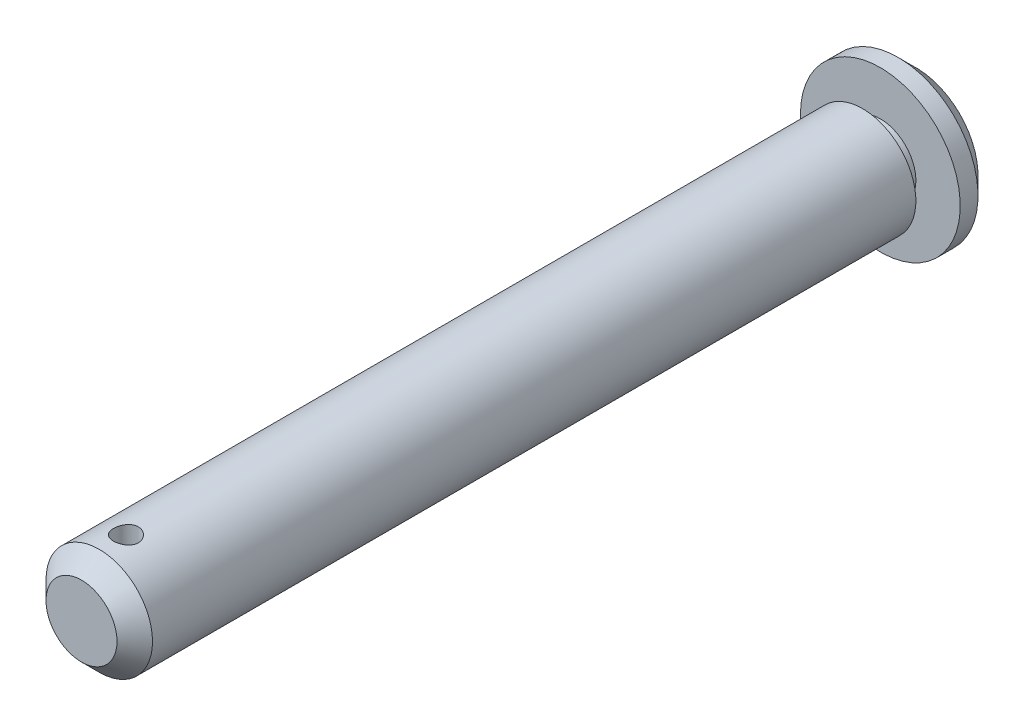
ISO-10303-21;
HEADER;
FILE_DESCRIPTION(('STEP AP214'),'2;1');
FILE_NAME('part.step','',(''),(''),'','','');
FILE_SCHEMA(('AUTOMOTIVE_DESIGN { 1 0 10303 214 1 1 1 1 }'));
ENDSEC;
DATA;
#1=APPLICATION_CONTEXT('core data for automotive mechanical design processes');
#2=APPLICATION_PROTOCOL_DEFINITION('international standard','automotive_design',2000,#1);
#3=PRODUCT_CONTEXT('',#1,'mechanical');
#4=PRODUCT('Part','Part','',(#3));
#5=PRODUCT_RELATED_PRODUCT_CATEGORY('part','',(#4));
#6=PRODUCT_DEFINITION_FORMATION('','',#4);
#7=PRODUCT_DEFINITION_CONTEXT('part definition',#1,'design');
#8=PRODUCT_DEFINITION('design','',#6,#7);
#9=PRODUCT_DEFINITION_SHAPE('','',#8);
#10=(LENGTH_UNIT() NAMED_UNIT(*) SI_UNIT(.MILLI.,.METRE.));
#11=(NAMED_UNIT(*) PLANE_ANGLE_UNIT() SI_UNIT($,.RADIAN.));
#12=(NAMED_UNIT(*) SI_UNIT($,.STERADIAN.) SOLID_ANGLE_UNIT());
#13=UNCERTAINTY_MEASURE_WITH_UNIT(LENGTH_MEASURE(1.E-05),#10,'distance_accuracy_value','');
#14=(GEOMETRIC_REPRESENTATION_CONTEXT(3) GLOBAL_UNCERTAINTY_ASSIGNED_CONTEXT((#13)) GLOBAL_UNIT_ASSIGNED_CONTEXT((#10,
#11,#12)) REPRESENTATION_CONTEXT('',''));
#15=CARTESIAN_POINT('',(0.,0.,0.));
#16=DIRECTION('',(0.,0.,1.));
#17=DIRECTION('',(1.,0.,0.));
#18=AXIS2_PLACEMENT_3D('',#15,#16,#17);
#19=CARTESIAN_POINT('',(0.,0.,0.));
#20=DIRECTION('',(0.,0.,1.));
#21=DIRECTION('',(1.,0.,0.));
#22=AXIS2_PLACEMENT_3D('',#19,#20,#21);
#23=PLANE('',#22);
#24=CARTESIAN_POINT('',(0.,0.,0.));
#25=DIRECTION('',(0.,0.,1.));
#26=DIRECTION('',(1.,0.,0.));
#27=AXIS2_PLACEMENT_3D('',#24,#25,#26);
#28=CIRCLE('',#27,2.00000000000001);
#29=CARTESIAN_POINT('',(2.00000000000001,0.,0.));
#30=VERTEX_POINT('',#29);
#31=EDGE_CURVE('E43',#30,#30,#28,.T.);
#32=ORIENTED_EDGE('',*,*,#31,.T.);
#33=EDGE_LOOP('',(#32));
#34=FACE_BOUND('',#33,.T.);
#35=ADVANCED_FACE('F32',(#34),#23,.T.);
#36=CARTESIAN_POINT('',(0.,0.,-47.));
#37=DIRECTION('',(0.,0.,-1.));
#38=DIRECTION('',(-1.,0.,0.));
#39=AXIS2_PLACEMENT_3D('',#36,#37,#38);
#40=CYLINDRICAL_SURFACE('',#39,3.);
#41=CARTESIAN_POINT('',(0.,0.,-0.999999999999987));
#42=DIRECTION('',(0.,0.,1.));
#43=DIRECTION('',(1.,0.,0.));
#44=AXIS2_PLACEMENT_3D('',#41,#42,#43);
#45=CIRCLE('',#44,3.);
#46=CARTESIAN_POINT('',(3.,0.,-0.999999999999987));
#47=VERTEX_POINT('',#46);
#48=EDGE_CURVE('E47',#47,#47,#45,.F.);
#49=ORIENTED_EDGE('',*,*,#48,.T.);
#50=EDGE_LOOP('',(#49));
#51=FACE_BOUND('',#50,.T.);
#52=CARTESIAN_POINT('',(0.,-3.,-1.8));
#53=CARTESIAN_POINT('',(-0.0387568275904303,-2.99999930231038,-1.80000122475109));
#54=CARTESIAN_POINT('',(-0.077527926090209,-2.99924138860332,-1.80322962052179));
#55=CARTESIAN_POINT('',(-0.153964355844702,-2.99629122555336,-1.81604183065357));
#56=CARTESIAN_POINT('',(-0.191628954369387,-2.99409804718746,-1.82562976149074));
#57=CARTESIAN_POINT('',(-0.264737067909907,-2.98852094902286,-1.85084084487668));
#58=CARTESIAN_POINT('',(-0.300183010279934,-2.98513835832486,-1.8664572628318));
#59=CARTESIAN_POINT('',(-0.367951228110604,-2.9775453193121,-1.90325958297396));
#60=CARTESIAN_POINT('',(-0.400273498836706,-2.97333486974259,-1.92444549360248));
#61=CARTESIAN_POINT('',(-0.461462979624396,-2.96446022027653,-1.97219117999056));
#62=CARTESIAN_POINT('',(-0.490265522898178,-2.95978975967682,-1.99883267308526));
#63=CARTESIAN_POINT('',(-0.543036619235344,-2.95056443308662,-2.05655805155119));
#64=CARTESIAN_POINT('',(-0.567004691963645,-2.94600957862161,-2.08764237782215));
#65=CARTESIAN_POINT('',(-0.609720258661536,-2.93746885752158,-2.15386000852436));
#66=CARTESIAN_POINT('',(-0.628397333551587,-2.93349098127653,-2.18903986216225));
#67=CARTESIAN_POINT('',(-0.65954851852384,-2.92664515060188,-2.26214734436777));
#68=CARTESIAN_POINT('',(-0.672023481476812,-2.92377704357666,-2.30007459431052));
#69=CARTESIAN_POINT('',(-0.690199482217611,-2.91953953127137,-2.37689430883357));
#70=CARTESIAN_POINT('',(-0.696015835093373,-2.91814464647746,-2.41575805244962));
#71=CARTESIAN_POINT('',(-0.701068363799087,-2.91693510858913,-2.49393280444522));
#72=CARTESIAN_POINT('',(-0.700305465035226,-2.91712023325807,-2.53324374914683));
#73=CARTESIAN_POINT('',(-0.692313585034032,-2.91902680303702,-2.61032794857285));
#74=CARTESIAN_POINT('',(-0.685220095657972,-2.92071605402813,-2.64811616931967));
#75=CARTESIAN_POINT('',(-0.664983719394817,-2.9253894582439,-2.72195092980324));
#76=CARTESIAN_POINT('',(-0.651840451464232,-2.92837369303204,-2.75799735967576));
#77=CARTESIAN_POINT('',(-0.619757276544303,-2.93533155315182,-2.82769824244883));
#78=CARTESIAN_POINT('',(-0.600766600275995,-2.93931378475101,-2.86132843132516));
#79=CARTESIAN_POINT('',(-0.557563290499968,-2.94781385649384,-2.92497422305259));
#80=CARTESIAN_POINT('',(-0.533349853055532,-2.95233177904783,-2.95498926831693));
#81=CARTESIAN_POINT('',(-0.479678060510791,-2.96153115527003,-3.01133124562877));
#82=CARTESIAN_POINT('',(-0.450104875328551,-2.96621389103577,-3.0375487017123));
#83=CARTESIAN_POINT('',(-0.38692699527782,-2.97511404536421,-3.08467126228309));
#84=CARTESIAN_POINT('',(-0.353322206496245,-2.97933145308307,-3.10557624298498));
#85=CARTESIAN_POINT('',(-0.282891253492208,-2.98684256664561,-3.14151334587868));
#86=CARTESIAN_POINT('',(-0.246056696201606,-2.99013376632089,-3.1565295764085));
#87=CARTESIAN_POINT('',(-0.170292807588434,-2.99540322643007,-3.18012785573254));
#88=CARTESIAN_POINT('',(-0.131363825153092,-2.99738170480818,-3.18871097261349));
#89=CARTESIAN_POINT('',(-0.0534537942300148,-2.99977122201387,-3.1990365681662));
#90=CARTESIAN_POINT('',(-0.0144935583276208,-3.00021647191604,-3.20092837714057));
#91=CARTESIAN_POINT('',(0.0631864227643716,-2.99958594191354,-3.19822458268463));
#92=CARTESIAN_POINT('',(0.101906186415341,-2.99851028025804,-3.1936294836042));
#93=CARTESIAN_POINT('',(0.177500428076711,-2.99498053429404,-3.17820584748606));
#94=CARTESIAN_POINT('',(0.214392074332031,-2.9925440939738,-3.16745705601246));
#95=CARTESIAN_POINT('',(0.285847949772057,-2.98656620093982,-3.14012082631615));
#96=CARTESIAN_POINT('',(0.320411962525002,-2.98302464564052,-3.12353284603515));
#97=CARTESIAN_POINT('',(0.386838432816381,-2.97514597920219,-3.08468784922727));
#98=CARTESIAN_POINT('',(0.418649240446618,-2.9707971217843,-3.06234494673881));
#99=CARTESIAN_POINT('',(0.478123395146006,-2.96180760471102,-3.01273590611791));
#100=CARTESIAN_POINT('',(0.505786122698787,-2.95716690161504,-2.98546903392765));
#101=CARTESIAN_POINT('',(0.556780719269184,-2.94799626826594,-2.92609685222967));
#102=CARTESIAN_POINT('',(0.58000852948651,-2.9434707616056,-2.89390134860149));
#103=CARTESIAN_POINT('',(0.620729338762077,-2.93515395619035,-2.82597959417895));
#104=CARTESIAN_POINT('',(0.638222593658529,-2.93136262468445,-2.7902535009889));
#105=CARTESIAN_POINT('',(0.666852672701944,-2.92498252731811,-2.71647977000186));
#106=CARTESIAN_POINT('',(0.678026628701683,-2.92238675351838,-2.67844717909831));
#107=CARTESIAN_POINT('',(0.693805497047128,-2.91868135294602,-2.60097475812476));
#108=CARTESIAN_POINT('',(0.698411629847287,-2.91757145006633,-2.56153519090027));
#109=CARTESIAN_POINT('',(0.700866695503486,-2.9169825334026,-2.48342172525));
#110=CARTESIAN_POINT('',(0.698881174718093,-2.91746356292556,-2.44475324177562));
#111=CARTESIAN_POINT('',(0.68858335414095,-2.91991103408463,-2.36831848010456));
#112=CARTESIAN_POINT('',(0.68027115130334,-2.92187745295769,-2.33055218809128));
#113=CARTESIAN_POINT('',(0.657640758090693,-2.92705336708224,-2.25714725476981));
#114=CARTESIAN_POINT('',(0.643349812401463,-2.93025721842348,-2.22149978927411));
#115=CARTESIAN_POINT('',(0.609189934206348,-2.93754852004272,-2.15308500202411));
#116=CARTESIAN_POINT('',(0.589320330706113,-2.94163607659811,-2.12031802735475));
#117=CARTESIAN_POINT('',(0.544031717337374,-2.95035113826687,-2.05778544845911));
#118=CARTESIAN_POINT('',(0.518496108741533,-2.9549888598669,-2.02810569795504));
#119=CARTESIAN_POINT('',(0.462832618993101,-2.96421665501473,-1.97339846919591));
#120=CARTESIAN_POINT('',(0.432703667310726,-2.96880671718791,-1.94837207848405));
#121=CARTESIAN_POINT('',(0.368155688067127,-2.97750512274554,-1.90331409369141));
#122=CARTESIAN_POINT('',(0.333678359340243,-2.98160507375448,-1.88336429305148));
#123=CARTESIAN_POINT('',(0.261769131843766,-2.98877534070089,-1.84957521569021));
#124=CARTESIAN_POINT('',(0.224339578019469,-2.99184646385879,-1.83573114568771));
#125=CARTESIAN_POINT('',(0.155764092090431,-2.99610696244778,-1.81682989219721));
#126=CARTESIAN_POINT('',(0.124970474288143,-2.99755737306338,-1.81053142605946));
#127=CARTESIAN_POINT('',(0.0627876704666706,-2.99950414730721,-1.80211610283141));
#128=CARTESIAN_POINT('',(0.0313985184421443,-3.00000056522738,-1.79999900777819));
#129=CARTESIAN_POINT('',(0.,-3.,-1.8));
#130=B_SPLINE_CURVE_WITH_KNOTS('',3,(#52,#53,#54,#55,#56,#57,#58,#59,#60,#61,#62,#63,#64,#65,
#66,#67,#68,#69,#70,#71,#72,#73,#74,#75,#76,#77,#78,#79,#80,#81,#82,#83,#84,#85,#86,#87,#88,#89,
#90,#91,#92,#93,#94,#95,#96,#97,#98,#99,#100,#101,#102,#103,#104,#105,#106,#107,#108,#109,#110,
#111,#112,#113,#114,#115,#116,#117,#118,#119,#120,#121,#122,#123,#124,#125,#126,#127,#128,#129),
.UNSPECIFIED.,.T.,.F.,(4,2,2,2,2,2,2,2,2,2,2,2,2,2,2,2,2,2,2,2,2,2,2,2,2,2,2,2,2,2,2,2,2,2,2,2,
2,2,4),(0.,0.116155492959679,0.232386245908476,0.348487528198088,0.464588986459406,
0.582576757191584,0.70057624498335,0.82007942476726,0.939566166766685,1.05695072959114,
1.17431878193162,1.28923352596519,1.4041555088601,1.52010484847293,1.63607204885624,
1.75490515703043,1.87374103386748,1.99289543559479,2.11203004978968,2.22848854369423,
2.34493798357922,2.45991145414755,2.57489560064481,2.69170669561784,2.80853521900645,
2.92783651281347,3.04713248345538,3.16571999359298,3.2842854645373,3.39989596837181,
3.51550470055238,3.6305922538747,3.74569365572602,3.86342932024183,3.9811924664321,
4.10074746266924,4.22020843490608,4.31431618805317,4.40841858534926),.UNSPECIFIED.);
#131=CARTESIAN_POINT('',(0.,-3.,-1.8));
#132=VERTEX_POINT('',#131);
#133=EDGE_CURVE('E53',#132,#132,#130,.T.);
#134=ORIENTED_EDGE('',*,*,#133,.F.);
#135=EDGE_LOOP('',(#134));
#136=FACE_BOUND('',#135,.T.);
#137=CARTESIAN_POINT('',(0.,3.,-1.8));
#138=CARTESIAN_POINT('',(0.0387568275904303,2.99999930231038,-1.80000122475109));
#139=CARTESIAN_POINT('',(0.077527926090209,2.99924138860332,-1.80322962052179));
#140=CARTESIAN_POINT('',(0.153964355844702,2.99629122555336,-1.81604183065357));
#141=CARTESIAN_POINT('',(0.191628954369387,2.99409804718746,-1.82562976149074));
#142=CARTESIAN_POINT('',(0.264737067909907,2.98852094902286,-1.85084084487668));
#143=CARTESIAN_POINT('',(0.300183010279934,2.98513835832486,-1.8664572628318));
#144=CARTESIAN_POINT('',(0.367951228110604,2.9775453193121,-1.90325958297396));
#145=CARTESIAN_POINT('',(0.400273498836706,2.97333486974259,-1.92444549360248));
#146=CARTESIAN_POINT('',(0.461462979624396,2.96446022027653,-1.97219117999056));
#147=CARTESIAN_POINT('',(0.490265522898178,2.95978975967682,-1.99883267308526));
#148=CARTESIAN_POINT('',(0.543036619235344,2.95056443308662,-2.05655805155119));
#149=CARTESIAN_POINT('',(0.567004691963645,2.94600957862161,-2.08764237782215));
#150=CARTESIAN_POINT('',(0.609720258661535,2.93746885752158,-2.15386000852436));
#151=CARTESIAN_POINT('',(0.628397333551587,2.93349098127653,-2.18903986216225));
#152=CARTESIAN_POINT('',(0.65954851852384,2.92664515060188,-2.26214734436777));
#153=CARTESIAN_POINT('',(0.672023481476812,2.92377704357666,-2.30007459431052));
#154=CARTESIAN_POINT('',(0.690199482217611,2.91953953127137,-2.37689430883357));
#155=CARTESIAN_POINT('',(0.696015835093373,2.91814464647746,-2.41575805244962));
#156=CARTESIAN_POINT('',(0.701068363799087,2.91693510858913,-2.49393280444522));
#157=CARTESIAN_POINT('',(0.700305465035226,2.91712023325807,-2.53324374914683));
#158=CARTESIAN_POINT('',(0.692313585034032,2.91902680303702,-2.61032794857285));
#159=CARTESIAN_POINT('',(0.685220095657972,2.92071605402813,-2.64811616931967));
#160=CARTESIAN_POINT('',(0.664983719394817,2.9253894582439,-2.72195092980324));
#161=CARTESIAN_POINT('',(0.651840451464232,2.92837369303204,-2.75799735967576));
#162=CARTESIAN_POINT('',(0.619757276544303,2.93533155315182,-2.82769824244883));
#163=CARTESIAN_POINT('',(0.600766600275995,2.93931378475101,-2.86132843132516));
#164=CARTESIAN_POINT('',(0.557563290499968,2.94781385649384,-2.92497422305259));
#165=CARTESIAN_POINT('',(0.533349853055532,2.95233177904783,-2.95498926831693));
#166=CARTESIAN_POINT('',(0.479678060510791,2.96153115527003,-3.01133124562877));
#167=CARTESIAN_POINT('',(0.450104875328551,2.96621389103577,-3.0375487017123));
#168=CARTESIAN_POINT('',(0.38692699527782,2.97511404536421,-3.08467126228309));
#169=CARTESIAN_POINT('',(0.353322206496245,2.97933145308307,-3.10557624298498));
#170=CARTESIAN_POINT('',(0.282891253492208,2.98684256664561,-3.14151334587868));
#171=CARTESIAN_POINT('',(0.246056696201606,2.99013376632089,-3.1565295764085));
#172=CARTESIAN_POINT('',(0.170292807588434,2.99540322643007,-3.18012785573254));
#173=CARTESIAN_POINT('',(0.131363825153092,2.99738170480818,-3.18871097261349));
#174=CARTESIAN_POINT('',(0.0534537942300148,2.99977122201387,-3.1990365681662));
#175=CARTESIAN_POINT('',(0.0144935583276209,3.00021647191604,-3.20092837714057));
#176=CARTESIAN_POINT('',(-0.0631864227643716,2.99958594191354,-3.19822458268463));
#177=CARTESIAN_POINT('',(-0.101906186415341,2.99851028025804,-3.1936294836042));
#178=CARTESIAN_POINT('',(-0.177500428076711,2.99498053429404,-3.17820584748606));
#179=CARTESIAN_POINT('',(-0.214392074332031,2.9925440939738,-3.16745705601246));
#180=CARTESIAN_POINT('',(-0.285847949772057,2.98656620093982,-3.14012082631615));
#181=CARTESIAN_POINT('',(-0.320411962525002,2.98302464564052,-3.12353284603515));
#182=CARTESIAN_POINT('',(-0.386838432816381,2.97514597920219,-3.08468784922727));
#183=CARTESIAN_POINT('',(-0.418649240446618,2.9707971217843,-3.06234494673881));
#184=CARTESIAN_POINT('',(-0.478123395146006,2.96180760471102,-3.01273590611791));
#185=CARTESIAN_POINT('',(-0.505786122698787,2.95716690161504,-2.98546903392765));
#186=CARTESIAN_POINT('',(-0.556780719269184,2.94799626826594,-2.92609685222967));
#187=CARTESIAN_POINT('',(-0.580008529486511,2.9434707616056,-2.89390134860149));
#188=CARTESIAN_POINT('',(-0.620729338762077,2.93515395619035,-2.82597959417895));
#189=CARTESIAN_POINT('',(-0.638222593658528,2.93136262468445,-2.7902535009889));
#190=CARTESIAN_POINT('',(-0.666852672701943,2.92498252731811,-2.71647977000186));
#191=CARTESIAN_POINT('',(-0.678026628701683,2.92238675351838,-2.67844717909831));
#192=CARTESIAN_POINT('',(-0.693805497047128,2.91868135294602,-2.60097475812476));
#193=CARTESIAN_POINT('',(-0.698411629847287,2.91757145006633,-2.56153519090027));
#194=CARTESIAN_POINT('',(-0.700866695503486,2.9169825334026,-2.48342172525));
#195=CARTESIAN_POINT('',(-0.698881174718093,2.91746356292556,-2.44475324177562));
#196=CARTESIAN_POINT('',(-0.68858335414095,2.91991103408463,-2.36831848010456));
#197=CARTESIAN_POINT('',(-0.68027115130334,2.92187745295769,-2.33055218809128));
#198=CARTESIAN_POINT('',(-0.657640758090693,2.92705336708224,-2.25714725476981));
#199=CARTESIAN_POINT('',(-0.643349812401463,2.93025721842348,-2.22149978927411));
#200=CARTESIAN_POINT('',(-0.609189934206348,2.93754852004272,-2.15308500202411));
#201=CARTESIAN_POINT('',(-0.589320330706113,2.94163607659811,-2.12031802735475));
#202=CARTESIAN_POINT('',(-0.544031717337374,2.95035113826687,-2.05778544845911));
#203=CARTESIAN_POINT('',(-0.518496108741533,2.9549888598669,-2.02810569795504));
#204=CARTESIAN_POINT('',(-0.462832618993101,2.96421665501473,-1.97339846919592));
#205=CARTESIAN_POINT('',(-0.432703667310726,2.96880671718791,-1.94837207848405));
#206=CARTESIAN_POINT('',(-0.368155688067128,2.97750512274554,-1.90331409369141));
#207=CARTESIAN_POINT('',(-0.333678359340243,2.98160507375449,-1.88336429305148));
#208=CARTESIAN_POINT('',(-0.261769131843766,2.98877534070089,-1.84957521569021));
#209=CARTESIAN_POINT('',(-0.224339578019469,2.99184646385879,-1.83573114568771));
#210=CARTESIAN_POINT('',(-0.155764092090431,2.99610696244778,-1.81682989219721));
#211=CARTESIAN_POINT('',(-0.124970474288143,2.99755737306338,-1.81053142605946));
#212=CARTESIAN_POINT('',(-0.0627876704666709,2.99950414730721,-1.80211610283141));
#213=CARTESIAN_POINT('',(-0.0313985184421444,3.00000056522738,-1.79999900777819));
#214=CARTESIAN_POINT('',(0.,3.,-1.8));
#215=B_SPLINE_CURVE_WITH_KNOTS('',3,(#137,#138,#139,#140,#141,#142,#143,#144,#145,#146,#147,
#148,#149,#150,#151,#152,#153,#154,#155,#156,#157,#158,#159,#160,#161,#162,#163,#164,#165,#166,
#167,#168,#169,#170,#171,#172,#173,#174,#175,#176,#177,#178,#179,#180,#181,#182,#183,#184,#185,
#186,#187,#188,#189,#190,#191,#192,#193,#194,#195,#196,#197,#198,#199,#200,#201,#202,#203,#204,
#205,#206,#207,#208,#209,#210,#211,#212,#213,#214),.UNSPECIFIED.,.T.,.F.,(4,2,2,2,2,2,2,2,2,2,2,
2,2,2,2,2,2,2,2,2,2,2,2,2,2,2,2,2,2,2,2,2,2,2,2,2,2,2,4),(0.,0.116155492959679,
0.232386245908476,0.348487528198088,0.464588986459406,0.582576757191584,0.70057624498335,
0.820079424767259,0.939566166766685,1.05695072959114,1.17431878193162,1.28923352596519,
1.4041555088601,1.52010484847293,1.63607204885624,1.75490515703043,1.87374103386748,
1.99289543559479,2.11203004978968,2.22848854369423,2.34493798357922,2.45991145414755,
2.57489560064481,2.69170669561784,2.80853521900645,2.92783651281347,3.04713248345538,
3.16571999359298,3.2842854645373,3.39989596837181,3.51550470055238,3.6305922538747,
3.74569365572602,3.86342932024183,3.9811924664321,4.10074746266924,4.22020843490608,
4.31431618805317,4.40841858534926),.UNSPECIFIED.);
#216=CARTESIAN_POINT('',(0.,3.,-1.8));
#217=VERTEX_POINT('',#216);
#218=EDGE_CURVE('E62',#217,#217,#215,.T.);
#219=ORIENTED_EDGE('',*,*,#218,.F.);
#220=EDGE_LOOP('',(#219));
#221=FACE_BOUND('',#220,.T.);
#222=CARTESIAN_POINT('',(0.,0.,-44.));
#223=DIRECTION('',(0.,0.,-1.));
#224=DIRECTION('',(-1.,0.,0.));
#225=AXIS2_PLACEMENT_3D('',#222,#223,#224);
#226=CIRCLE('',#225,3.);
#227=CARTESIAN_POINT('',(-3.,0.,-44.));
#228=VERTEX_POINT('',#227);
#229=EDGE_CURVE('E52',#228,#228,#226,.T.);
#230=ORIENTED_EDGE('',*,*,#229,.F.);
#231=EDGE_LOOP('',(#230));
#232=FACE_BOUND('',#231,.T.);
#233=ADVANCED_FACE('F67',(#51,#136,#221,#232),#40,.T.);
#234=CARTESIAN_POINT('',(-3.,0.,-44.));
#235=DIRECTION('',(0.,0.,-1.));
#236=DIRECTION('',(-1.,0.,0.));
#237=AXIS2_PLACEMENT_3D('',#234,#235,#236);
#238=PLANE('',#237);
#239=ORIENTED_EDGE('',*,*,#229,.T.);
#240=EDGE_LOOP('',(#239));
#241=FACE_BOUND('',#240,.T.);
#242=CARTESIAN_POINT('',(0.,0.,-44.));
#243=DIRECTION('',(0.,0.,-1.));
#244=DIRECTION('',(-1.,0.,0.));
#245=AXIS2_PLACEMENT_3D('',#242,#243,#244);
#246=CIRCLE('',#245,2.);
#247=CARTESIAN_POINT('',(-2.,0.,-44.));
#248=VERTEX_POINT('',#247);
#249=EDGE_CURVE('E120',#248,#248,#246,.T.);
#250=ORIENTED_EDGE('',*,*,#249,.F.);
#251=EDGE_LOOP('',(#250));
#252=FACE_BOUND('',#251,.T.);
#253=ADVANCED_FACE('F90',(#241,#252),#238,.T.);
#254=CARTESIAN_POINT('',(0.,0.,-47.));
#255=DIRECTION('',(0.,0.,-1.));
#256=DIRECTION('',(-1.,0.,0.));
#257=AXIS2_PLACEMENT_3D('',#254,#255,#256);
#258=CYLINDRICAL_SURFACE('',#257,2.);
#259=ORIENTED_EDGE('',*,*,#249,.T.);
#260=EDGE_LOOP('',(#259));
#261=FACE_BOUND('',#260,.T.);
#262=CARTESIAN_POINT('',(0.,0.,-45.));
#263=DIRECTION('',(0.,0.,-1.));
#264=DIRECTION('',(-1.,0.,0.));
#265=AXIS2_PLACEMENT_3D('',#262,#263,#264);
#266=CIRCLE('',#265,2.);
#267=CARTESIAN_POINT('',(-2.,0.,-45.));
#268=VERTEX_POINT('',#267);
#269=EDGE_CURVE('E122',#268,#268,#266,.T.);
#270=ORIENTED_EDGE('',*,*,#269,.F.);
#271=EDGE_LOOP('',(#270));
#272=FACE_BOUND('',#271,.T.);
#273=ADVANCED_FACE('F87',(#261,#272),#258,.T.);
#274=CARTESIAN_POINT('',(-2.,0.,-45.));
#275=DIRECTION('',(0.,0.,1.));
#276=DIRECTION('',(1.,0.,0.));
#277=AXIS2_PLACEMENT_3D('',#274,#275,#276);
#278=PLANE('',#277);
#279=ORIENTED_EDGE('',*,*,#269,.T.);
#280=EDGE_LOOP('',(#279));
#281=FACE_BOUND('',#280,.T.);
#282=CARTESIAN_POINT('',(0.,0.,-45.));
#283=DIRECTION('',(0.,0.,-1.));
#284=DIRECTION('',(-1.,0.,0.));
#285=AXIS2_PLACEMENT_3D('',#282,#283,#284);
#286=CIRCLE('',#285,4.5);
#287=CARTESIAN_POINT('',(-4.5,0.,-45.));
#288=VERTEX_POINT('',#287);
#289=EDGE_CURVE('E61',#288,#288,#286,.T.);
#290=ORIENTED_EDGE('',*,*,#289,.F.);
#291=EDGE_LOOP('',(#290));
#292=FACE_BOUND('',#291,.T.);
#293=ADVANCED_FACE('F84',(#281,#292),#278,.T.);
#294=CARTESIAN_POINT('',(0.,0.,-47.));
#295=DIRECTION('',(0.,0.,-1.));
#296=DIRECTION('',(-1.,0.,0.));
#297=AXIS2_PLACEMENT_3D('',#294,#295,#296);
#298=CYLINDRICAL_SURFACE('',#297,4.5);
#299=CARTESIAN_POINT('',(0.,0.,-46.));
#300=DIRECTION('',(0.,0.,-1.));
#301=DIRECTION('',(-1.,0.,0.));
#302=AXIS2_PLACEMENT_3D('',#299,#300,#301);
#303=CIRCLE('',#302,4.5);
#304=CARTESIAN_POINT('',(-4.5,0.,-46.));
#305=VERTEX_POINT('',#304);
#306=EDGE_CURVE('E10',#305,#305,#303,.F.);
#307=ORIENTED_EDGE('',*,*,#306,.T.);
#308=EDGE_LOOP('',(#307));
#309=FACE_BOUND('',#308,.T.);
#310=ORIENTED_EDGE('',*,*,#289,.T.);
#311=EDGE_LOOP('',(#310));
#312=FACE_BOUND('',#311,.T.);
#313=ADVANCED_FACE('F81',(#309,#312),#298,.T.);
#314=CARTESIAN_POINT('',(-4.5,0.,-47.));
#315=DIRECTION('',(0.,0.,-1.));
#316=DIRECTION('',(-1.,0.,0.));
#317=AXIS2_PLACEMENT_3D('',#314,#315,#316);
#318=PLANE('',#317);
#319=CARTESIAN_POINT('',(0.,0.,-47.));
#320=DIRECTION('',(0.,0.,-1.));
#321=DIRECTION('',(-1.,0.,0.));
#322=AXIS2_PLACEMENT_3D('',#319,#320,#321);
#323=CIRCLE('',#322,3.5);
#324=CARTESIAN_POINT('',(-3.5,0.,-47.));
#325=VERTEX_POINT('',#324);
#326=EDGE_CURVE('E39',#325,#325,#323,.T.);
#327=ORIENTED_EDGE('',*,*,#326,.T.);
#328=EDGE_LOOP('',(#327));
#329=FACE_BOUND('',#328,.T.);
#330=ADVANCED_FACE('F76',(#329),#318,.T.);
#331=CARTESIAN_POINT('',(0.,-4.5,-2.5));
#332=DIRECTION('',(0.,1.,0.));
#333=DIRECTION('',(0.,0.,1.));
#334=AXIS2_PLACEMENT_3D('',#331,#332,#333);
#335=CYLINDRICAL_SURFACE('',#334,0.7);
#336=ORIENTED_EDGE('',*,*,#133,.T.);
#337=EDGE_LOOP('',(#336));
#338=FACE_BOUND('',#337,.T.);
#339=ORIENTED_EDGE('',*,*,#218,.T.);
#340=EDGE_LOOP('',(#339));
#341=FACE_BOUND('',#340,.T.);
#342=ADVANCED_FACE('F71',(#338,#341),#335,.F.);
#343=CARTESIAN_POINT('',(0.,0.,-0.999999999999987));
#344=DIRECTION('',(0.,0.,-1.));
#345=DIRECTION('',(-1.,0.,0.));
#346=AXIS2_PLACEMENT_3D('',#343,#344,#345);
#347=CONICAL_SURFACE('',#346,3.,0.78539816339745);
#348=ORIENTED_EDGE('',*,*,#31,.F.);
#349=EDGE_LOOP('',(#348));
#350=FACE_BOUND('',#349,.T.);
#351=ORIENTED_EDGE('',*,*,#48,.F.);
#352=EDGE_LOOP('',(#351));
#353=FACE_BOUND('',#352,.T.);
#354=ADVANCED_FACE('F75',(#350,#353),#347,.T.);
#355=CARTESIAN_POINT('',(0.,0.,-47.));
#356=DIRECTION('',(0.,0.,1.));
#357=DIRECTION('',(1.,0.,0.));
#358=AXIS2_PLACEMENT_3D('',#355,#356,#357);
#359=CONICAL_SURFACE('',#358,3.5,0.785398163397446);
#360=ORIENTED_EDGE('',*,*,#306,.F.);
#361=EDGE_LOOP('',(#360));
#362=FACE_BOUND('',#361,.T.);
#363=ORIENTED_EDGE('',*,*,#326,.F.);
#364=EDGE_LOOP('',(#363));
#365=FACE_BOUND('',#364,.T.);
#366=ADVANCED_FACE('F34',(#362,#365),#359,.T.);
#367=CLOSED_SHELL('',(#35,#233,#253,#273,#293,#313,#330,#342,#354,#366));
#368=MANIFOLD_SOLID_BREP('B2',#367);
#369=ADVANCED_BREP_SHAPE_REPRESENTATION('',(#18,#368),#14);
#370=SHAPE_DEFINITION_REPRESENTATION(#9,#369);
ENDSEC;
END-ISO-10303-21;
